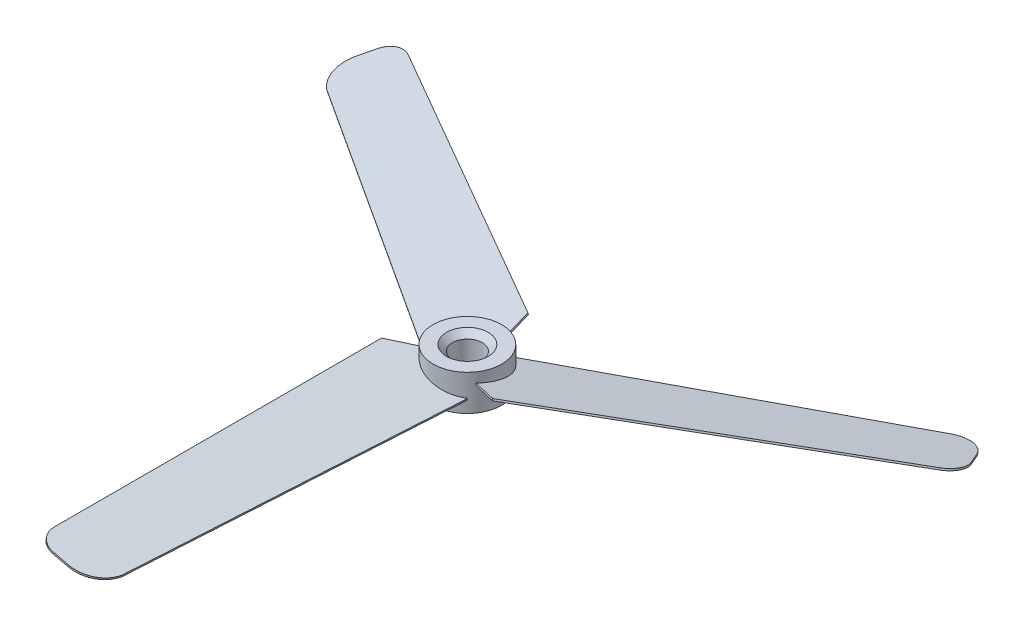
ISO-10303-21;
HEADER;
FILE_DESCRIPTION(('STEP AP214'),'2;1');
FILE_NAME('part.step','',(''),(''),'','','');
FILE_SCHEMA(('AUTOMOTIVE_DESIGN { 1 0 10303 214 1 1 1 1 }'));
ENDSEC;
DATA;
#1=APPLICATION_CONTEXT('core data for automotive mechanical design processes');
#2=APPLICATION_PROTOCOL_DEFINITION('international standard','automotive_design',2000,#1);
#3=PRODUCT_CONTEXT('',#1,'mechanical');
#4=PRODUCT('Part','Part','',(#3));
#5=PRODUCT_RELATED_PRODUCT_CATEGORY('part','',(#4));
#6=PRODUCT_DEFINITION_FORMATION('','',#4);
#7=PRODUCT_DEFINITION_CONTEXT('part definition',#1,'design');
#8=PRODUCT_DEFINITION('design','',#6,#7);
#9=PRODUCT_DEFINITION_SHAPE('','',#8);
#10=(LENGTH_UNIT() NAMED_UNIT(*) SI_UNIT(.MILLI.,.METRE.));
#11=(NAMED_UNIT(*) PLANE_ANGLE_UNIT() SI_UNIT($,.RADIAN.));
#12=(NAMED_UNIT(*) SI_UNIT($,.STERADIAN.) SOLID_ANGLE_UNIT());
#13=UNCERTAINTY_MEASURE_WITH_UNIT(LENGTH_MEASURE(1.E-05),#10,'distance_accuracy_value','');
#14=(GEOMETRIC_REPRESENTATION_CONTEXT(3) GLOBAL_UNCERTAINTY_ASSIGNED_CONTEXT((#13)) GLOBAL_UNIT_ASSIGNED_CONTEXT((#10,
#11,#12)) REPRESENTATION_CONTEXT('',''));
#15=CARTESIAN_POINT('',(0.,0.,0.));
#16=DIRECTION('',(0.,0.,1.));
#17=DIRECTION('',(1.,0.,0.));
#18=AXIS2_PLACEMENT_3D('',#15,#16,#17);
#19=CARTESIAN_POINT('',(0.,3.,0.));
#20=DIRECTION('',(0.,-1.,0.));
#21=DIRECTION('',(0.,0.,-1.));
#22=AXIS2_PLACEMENT_3D('',#19,#20,#21);
#23=CYLINDRICAL_SURFACE('',#22,5.75);
#24=CARTESIAN_POINT('',(0.,-19.4055087013538,0.));
#25=DIRECTION('',(0.443375650604073,0.224670968725066,0.867721722825674));
#26=DIRECTION('',(0.102227105047157,-0.974434685246857,0.200066646849336));
#27=AXIS2_PLACEMENT_3D('',#24,#25,#26);
#28=ELLIPSE('',#27,25.5929817396051,5.75);
#29=CARTESIAN_POINT('',(1.55101312725636,-1.0819336896782,-5.5368635777919));
#30=VERTEX_POINT('',#29);
#31=CARTESIAN_POINT('',(1.45445813438666,-0.790415335423243,-5.5630074182331));
#32=VERTEX_POINT('',#31);
#33=EDGE_CURVE('E60',#30,#32,#28,.T.);
#34=ORIENTED_EDGE('',*,*,#33,.F.);
#35=CARTESIAN_POINT('',(0.,-0.153945616169009,0.));
#36=DIRECTION('',(0.112475527171931,-0.974370064785235,0.194813327669882));
#37=DIRECTION('',(-0.48718503239261,-0.224951054343866,-0.843829228791108));
#38=AXIS2_PLACEMENT_3D('',#35,#36,#37);
#39=ELLIPSE('',#38,5.901248619812,5.75);
#40=CARTESIAN_POINT('',(4.7119520671484,1.04885957941083,3.2954525814971));
#41=VERTEX_POINT('',#40);
#42=EDGE_CURVE('E64',#30,#41,#39,.T.);
#43=ORIENTED_EDGE('',*,*,#42,.T.);
#44=CARTESIAN_POINT('',(0.,9.96257157509144,0.));
#45=DIRECTION('',(0.376322422140342,-0.139682244482034,-0.915898632584899));
#46=DIRECTION('',(-0.0530859955112098,-0.990196379803755,0.129201418351822));
#47=AXIS2_PLACEMENT_3D('',#44,#45,#46);
#48=ELLIPSE('',#47,41.1648597237395,5.75);
#49=CARTESIAN_POINT('',(4.7369454910711,1.35243251248231,3.25942439927991));
#50=VERTEX_POINT('',#49);
#51=EDGE_CURVE('E395',#50,#41,#48,.T.);
#52=ORIENTED_EDGE('',*,*,#51,.F.);
#53=CARTESIAN_POINT('',(0.,0.153945616169009,0.));
#54=DIRECTION('',(0.112475527171931,-0.974370064785235,0.194813327669882));
#55=DIRECTION('',(-0.48718503239261,-0.224951054343866,-0.843829228791108));
#56=AXIS2_PLACEMENT_3D('',#53,#54,#55);
#57=ELLIPSE('',#56,5.901248619812,5.75);
#58=EDGE_CURVE('E391',#32,#50,#57,.T.);
#59=ORIENTED_EDGE('',*,*,#58,.F.);
#60=EDGE_LOOP('',(#34,#43,#52,#59));
#61=FACE_BOUND('',#60,.T.);
#62=CARTESIAN_POINT('',(0.,-19.4055087013538,0.));
#63=DIRECTION('',(0.529781230080593,0.224670968725066,-0.81783543825542));
#64=DIRECTION('',(0.122149246097916,-0.974434685246857,-0.188564593350847));
#65=AXIS2_PLACEMENT_3D('',#62,#63,#64);
#66=ELLIPSE('',#65,25.5929817396051,5.75);
#67=CARTESIAN_POINT('',(-5.57057107928475,-1.08193368967819,1.42521501908883));
#68=VERTEX_POINT('',#67);
#69=CARTESIAN_POINT('',(-5.54493481282447,-0.790415335423243,1.52190601599681));
#70=VERTEX_POINT('',#69);
#71=EDGE_CURVE('E384',#68,#70,#66,.T.);
#72=ORIENTED_EDGE('',*,*,#71,.F.);
#73=CARTESIAN_POINT('',(0.,-0.153945616169009,0.));
#74=DIRECTION('',(0.112475527171934,-0.974370064785235,-0.194813327669881));
#75=DIRECTION('',(-0.487185032392622,-0.224951054343866,0.843829228791101));
#76=AXIS2_PLACEMENT_3D('',#73,#74,#75);
#77=ELLIPSE('',#76,5.901248619812,5.75);
#78=CARTESIAN_POINT('',(0.497969618969275,1.04885957941083,-5.72839648231367));
#79=VERTEX_POINT('',#78);
#80=EDGE_CURVE('E388',#68,#79,#77,.T.);
#81=ORIENTED_EDGE('',*,*,#80,.T.);
#82=CARTESIAN_POINT('',(0.,9.96257157509143,0.));
#83=DIRECTION('',(-0.981352694180123,-0.139682244482034,0.132044538705226));
#84=DIRECTION('',(0.138434708253263,-0.990196379803755,-0.018626888478017));
#85=AXIS2_PLACEMENT_3D('',#82,#83,#84);
#86=ELLIPSE('',#85,41.1648597237395,5.75);
#87=CARTESIAN_POINT('',(0.45427158595566,1.35243251248231,-5.73202733124968));
#88=VERTEX_POINT('',#87);
#89=EDGE_CURVE('E380',#88,#79,#86,.T.);
#90=ORIENTED_EDGE('',*,*,#89,.F.);
#91=CARTESIAN_POINT('',(0.,0.153945616169009,0.));
#92=DIRECTION('',(0.112475527171934,-0.974370064785235,-0.194813327669881));
#93=DIRECTION('',(-0.487185032392622,-0.224951054343866,0.843829228791101));
#94=AXIS2_PLACEMENT_3D('',#91,#92,#93);
#95=ELLIPSE('',#94,5.901248619812,5.75);
#96=EDGE_CURVE('E376',#70,#88,#95,.T.);
#97=ORIENTED_EDGE('',*,*,#96,.F.);
#98=EDGE_LOOP('',(#72,#81,#90,#97));
#99=FACE_BOUND('',#98,.T.);
#100=CARTESIAN_POINT('',(0.,-19.4055087013538,0.));
#101=DIRECTION('',(-0.97315688068467,0.224670968725066,-0.0498862845702472));
#102=DIRECTION('',(-0.224376351145074,-0.974434685246857,-0.0115020534984881));
#103=AXIS2_PLACEMENT_3D('',#100,#101,#102);
#104=ELLIPSE('',#103,25.5929817396051,5.75);
#105=CARTESIAN_POINT('',(4.01955795202844,-1.08193368967819,4.11164855870306));
#106=VERTEX_POINT('',#105);
#107=CARTESIAN_POINT('',(4.09047667843786,-0.790415335423243,4.04110140223628));
#108=VERTEX_POINT('',#107);
#109=EDGE_CURVE('E369',#106,#108,#104,.T.);
#110=ORIENTED_EDGE('',*,*,#109,.F.);
#111=CARTESIAN_POINT('',(0.,-0.153945616169009,0.));
#112=DIRECTION('',(-0.224951054343866,-0.974370064785235,0.));
#113=DIRECTION('',(0.974370064785235,-0.224951054343866,0.));
#114=AXIS2_PLACEMENT_3D('',#111,#112,#113);
#115=ELLIPSE('',#114,5.901248619812,5.75);
#116=CARTESIAN_POINT('',(-5.20992168611768,1.04885957941083,2.43294390081661));
#117=VERTEX_POINT('',#116);
#118=EDGE_CURVE('E373',#106,#117,#115,.T.);
#119=ORIENTED_EDGE('',*,*,#118,.T.);
#120=CARTESIAN_POINT('',(0.,9.96257157509143,0.));
#121=DIRECTION('',(0.605030272039788,-0.139682244482034,0.783854093879672));
#122=DIRECTION('',(-0.0853487127420546,-0.990196379803755,-0.110574529873804));
#123=AXIS2_PLACEMENT_3D('',#120,#121,#122);
#124=ELLIPSE('',#123,41.1648597237395,5.75);
#125=CARTESIAN_POINT('',(-5.19121707702676,1.35243251248231,2.47260293196982));
#126=VERTEX_POINT('',#125);
#127=EDGE_CURVE('E365',#126,#117,#124,.T.);
#128=ORIENTED_EDGE('',*,*,#127,.F.);
#129=CARTESIAN_POINT('',(0.,0.153945616169009,0.));
#130=DIRECTION('',(-0.224951054343866,-0.974370064785235,0.));
#131=DIRECTION('',(0.974370064785235,-0.224951054343866,0.));
#132=AXIS2_PLACEMENT_3D('',#129,#130,#131);
#133=ELLIPSE('',#132,5.901248619812,5.75);
#134=EDGE_CURVE('E358',#108,#126,#133,.T.);
#135=ORIENTED_EDGE('',*,*,#134,.F.);
#136=EDGE_LOOP('',(#110,#119,#128,#135));
#137=FACE_BOUND('',#136,.T.);
#138=CARTESIAN_POINT('',(0.,3.,0.));
#139=DIRECTION('',(0.,1.,0.));
#140=DIRECTION('',(0.,0.,1.));
#141=AXIS2_PLACEMENT_3D('',#138,#139,#140);
#142=CIRCLE('',#141,5.75);
#143=CARTESIAN_POINT('',(0.,3.,5.75));
#144=VERTEX_POINT('',#143);
#145=EDGE_CURVE('E354',#144,#144,#142,.T.);
#146=ORIENTED_EDGE('',*,*,#145,.F.);
#147=EDGE_LOOP('',(#146));
#148=FACE_BOUND('',#147,.T.);
#149=CARTESIAN_POINT('',(0.,-3.,0.));
#150=DIRECTION('',(0.,1.,0.));
#151=DIRECTION('',(0.,0.,1.));
#152=AXIS2_PLACEMENT_3D('',#149,#150,#151);
#153=CIRCLE('',#152,5.75);
#154=CARTESIAN_POINT('',(0.,-3.,5.75));
#155=VERTEX_POINT('',#154);
#156=EDGE_CURVE('E353',#155,#155,#153,.T.);
#157=ORIENTED_EDGE('',*,*,#156,.T.);
#158=EDGE_LOOP('',(#157));
#159=FACE_BOUND('',#158,.T.);
#160=ADVANCED_FACE('F43',(#61,#99,#137,#148,#159),#23,.T.);
#161=CARTESIAN_POINT('',(0.,3.,0.));
#162=DIRECTION('',(0.,1.,0.));
#163=DIRECTION('',(0.,0.,1.));
#164=AXIS2_PLACEMENT_3D('',#161,#162,#163);
#165=PLANE('',#164);
#166=CARTESIAN_POINT('',(0.,3.,0.));
#167=DIRECTION('',(0.,1.,0.));
#168=DIRECTION('',(0.,0.,1.));
#169=AXIS2_PLACEMENT_3D('',#166,#167,#168);
#170=CIRCLE('',#169,3.49999999999996);
#171=CARTESIAN_POINT('',(0.,3.,3.49999999999996));
#172=VERTEX_POINT('',#171);
#173=EDGE_CURVE('E11',#172,#172,#170,.F.);
#174=ORIENTED_EDGE('',*,*,#173,.T.);
#175=EDGE_LOOP('',(#174));
#176=FACE_BOUND('',#175,.T.);
#177=ORIENTED_EDGE('',*,*,#145,.T.);
#178=EDGE_LOOP('',(#177));
#179=FACE_BOUND('',#178,.T.);
#180=ADVANCED_FACE('F434',(#176,#179),#165,.T.);
#181=CARTESIAN_POINT('',(0.,-3.,0.));
#182=DIRECTION('',(0.,1.,0.));
#183=DIRECTION('',(0.,0.,1.));
#184=AXIS2_PLACEMENT_3D('',#181,#182,#183);
#185=PLANE('',#184);
#186=CARTESIAN_POINT('',(0.,-3.,0.));
#187=DIRECTION('',(0.,1.,0.));
#188=DIRECTION('',(0.,0.,1.));
#189=AXIS2_PLACEMENT_3D('',#186,#187,#188);
#190=CIRCLE('',#189,3.50000000000003);
#191=CARTESIAN_POINT('',(0.,-3.,3.50000000000003));
#192=VERTEX_POINT('',#191);
#193=EDGE_CURVE('E53',#192,#192,#190,.T.);
#194=ORIENTED_EDGE('',*,*,#193,.T.);
#195=EDGE_LOOP('',(#194));
#196=FACE_BOUND('',#195,.T.);
#197=ORIENTED_EDGE('',*,*,#156,.F.);
#198=EDGE_LOOP('',(#197));
#199=FACE_BOUND('',#198,.T.);
#200=ADVANCED_FACE('F413',(#196,#199),#185,.F.);
#201=CARTESIAN_POINT('',(4.11122933867557,-1.10309769689138,2.22805310777435));
#202=DIRECTION('',(-0.97315688068467,0.224670968725066,-0.0498862845702472));
#203=DIRECTION('',(-0.224951054343866,-0.974370064785235,0.));
#204=AXIS2_PLACEMENT_3D('',#201,#202,#203);
#205=PLANE('',#204);
#206=CARTESIAN_POINT('',(4.11122933867557,-1.10309769689138,2.22805310777435));
#207=CARTESIAN_POINT('',(1.33230436886286,-0.461532315837062,59.3273359162697));
#208=B_SPLINE_CURVE_WITH_KNOTS('',1,(#206,#207),.UNSPECIFIED.,.F.,.F.,(2,2),(0.,1.),.UNSPECIFIED.);
#209=CARTESIAN_POINT('',(1.33230436886285,-0.461532315837062,59.3273359162697));
#210=VERTEX_POINT('',#209);
#211=EDGE_CURVE('E286',#106,#210,#208,.T.);
#212=ORIENTED_EDGE('',*,*,#211,.F.);
#213=ORIENTED_EDGE('',*,*,#109,.T.);
#214=CARTESIAN_POINT('',(4.17871465497873,-0.810786677455814,2.22805310777435));
#215=CARTESIAN_POINT('',(1.39978968516602,-0.169221296401491,59.3273359162697));
#216=B_SPLINE_CURVE_WITH_KNOTS('',1,(#214,#215),.UNSPECIFIED.,.F.,.F.,(2,2),(0.,1.),.UNSPECIFIED.);
#217=CARTESIAN_POINT('',(1.39978968516601,-0.169221296401491,59.3273359162697));
#218=VERTEX_POINT('',#217);
#219=EDGE_CURVE('E285',#108,#218,#216,.T.);
#220=ORIENTED_EDGE('',*,*,#219,.T.);
#221=DIRECTION('',(0.224951054343866,0.974370064785235,0.));
#222=VECTOR('',#221,1.);
#223=CARTESIAN_POINT('',(1.33230436886285,-0.461532315837062,59.3273359162697));
#224=LINE('',#223,#222);
#225=EDGE_CURVE('E349',#210,#218,#224,.T.);
#226=ORIENTED_EDGE('',*,*,#225,.F.);
#227=EDGE_LOOP('',(#212,#213,#220,#226));
#228=FACE_BOUND('',#227,.T.);
#229=ADVANCED_FACE('F445',(#228),#205,.F.);
#230=CARTESIAN_POINT('',(-3.47238894338371,0.647718538074396,58.5));
#231=DIRECTION('',(0.224951054343866,0.974370064785235,0.));
#232=DIRECTION('',(-0.974370064785235,0.224951054343866,0.));
#233=AXIS2_PLACEMENT_3D('',#230,#231,#232);
#234=CYLINDRICAL_SURFACE('',#233,5.);
#235=CARTESIAN_POINT('',(-3.40490362708055,0.940029557509967,58.5));
#236=DIRECTION('',(-0.224951054343866,-0.974370064785235,0.));
#237=DIRECTION('',(0.974370064785235,-0.224951054343866,0.));
#238=AXIS2_PLACEMENT_3D('',#235,#236,#237);
#239=CIRCLE('',#238,5.);
#240=CARTESIAN_POINT('',(-3.40490362708055,0.940029557509967,63.5));
#241=VERTEX_POINT('',#240);
#242=EDGE_CURVE('E316',#218,#241,#239,.T.);
#243=ORIENTED_EDGE('',*,*,#242,.T.);
#244=DIRECTION('',(0.224951054343866,0.974370064785235,0.));
#245=VECTOR('',#244,1.);
#246=CARTESIAN_POINT('',(-3.47238894338371,0.647718538074396,63.5));
#247=LINE('',#246,#245);
#248=CARTESIAN_POINT('',(-3.47238894338371,0.647718538074396,63.5));
#249=VERTEX_POINT('',#248);
#250=EDGE_CURVE('E345',#249,#241,#247,.T.);
#251=ORIENTED_EDGE('',*,*,#250,.F.);
#252=CARTESIAN_POINT('',(-3.47238894338371,0.647718538074396,58.5));
#253=DIRECTION('',(-0.224951054343866,-0.974370064785235,0.));
#254=DIRECTION('',(0.974370064785235,-0.224951054343866,0.));
#255=AXIS2_PLACEMENT_3D('',#252,#253,#254);
#256=CIRCLE('',#255,5.);
#257=EDGE_CURVE('E291',#210,#249,#256,.T.);
#258=ORIENTED_EDGE('',*,*,#257,.F.);
#259=ORIENTED_EDGE('',*,*,#225,.T.);
#260=EDGE_LOOP('',(#243,#251,#258,#259));
#261=FACE_BOUND('',#260,.T.);
#262=ADVANCED_FACE('F450',(#261),#234,.T.);
#263=CARTESIAN_POINT('',(-6.05705871859665,1.24443657373473,63.5));
#264=DIRECTION('',(0.,0.,-1.));
#265=DIRECTION('',(-1.,0.,0.));
#266=AXIS2_PLACEMENT_3D('',#263,#264,#265);
#267=PLANE('',#266);
#268=DIRECTION('',(-0.974370064785235,0.224951054343866,0.));
#269=VECTOR('',#268,1.);
#270=CARTESIAN_POINT('',(-5.9895734022935,1.5367475931703,63.5));
#271=LINE('',#270,#269);
#272=CARTESIAN_POINT('',(-5.9895734022935,1.5367475931703,63.5));
#273=VERTEX_POINT('',#272);
#274=EDGE_CURVE('E322',#241,#273,#271,.T.);
#275=ORIENTED_EDGE('',*,*,#274,.T.);
#276=DIRECTION('',(0.224951054343866,0.974370064785235,0.));
#277=VECTOR('',#276,1.);
#278=CARTESIAN_POINT('',(-6.05705871859665,1.24443657373473,63.5));
#279=LINE('',#278,#277);
#280=CARTESIAN_POINT('',(-6.05705871859665,1.24443657373473,63.5));
#281=VERTEX_POINT('',#280);
#282=EDGE_CURVE('E341',#281,#273,#279,.T.);
#283=ORIENTED_EDGE('',*,*,#282,.F.);
#284=DIRECTION('',(-0.974370064785235,0.224951054343866,0.));
#285=VECTOR('',#284,1.);
#286=CARTESIAN_POINT('',(-6.05705871859665,1.24443657373473,63.5));
#287=LINE('',#286,#285);
#288=EDGE_CURVE('E298',#249,#281,#287,.T.);
#289=ORIENTED_EDGE('',*,*,#288,.F.);
#290=ORIENTED_EDGE('',*,*,#250,.T.);
#291=EDGE_LOOP('',(#275,#283,#289,#290));
#292=FACE_BOUND('',#291,.T.);
#293=ADVANCED_FACE('F461',(#292),#267,.F.);
#294=CARTESIAN_POINT('',(-6.05705871859665,1.24443657373473,60.5));
#295=DIRECTION('',(0.224951054343866,0.974370064785235,0.));
#296=DIRECTION('',(-0.974370064785235,0.224951054343866,0.));
#297=AXIS2_PLACEMENT_3D('',#294,#295,#296);
#298=CYLINDRICAL_SURFACE('',#297,3.);
#299=CARTESIAN_POINT('',(-5.9895734022935,1.5367475931703,60.5));
#300=DIRECTION('',(-0.224951054343866,-0.974370064785235,0.));
#301=DIRECTION('',(-0.974370064785235,0.224951054343866,0.));
#302=AXIS2_PLACEMENT_3D('',#299,#300,#301);
#303=CIRCLE('',#302,3.);
#304=CARTESIAN_POINT('',(-8.9126835966492,2.21160075620189,60.5));
#305=VERTEX_POINT('',#304);
#306=EDGE_CURVE('E325',#273,#305,#303,.T.);
#307=ORIENTED_EDGE('',*,*,#306,.T.);
#308=DIRECTION('',(0.224951054343866,0.974370064785235,0.));
#309=VECTOR('',#308,1.);
#310=CARTESIAN_POINT('',(-8.98016891295236,1.91928973676632,60.5));
#311=LINE('',#310,#309);
#312=CARTESIAN_POINT('',(-8.98016891295236,1.91928973676632,60.5));
#313=VERTEX_POINT('',#312);
#314=EDGE_CURVE('E337',#313,#305,#311,.T.);
#315=ORIENTED_EDGE('',*,*,#314,.F.);
#316=CARTESIAN_POINT('',(-6.05705871859665,1.24443657373473,60.5));
#317=DIRECTION('',(-0.224951054343866,-0.974370064785235,0.));
#318=DIRECTION('',(-0.974370064785235,0.224951054343866,0.));
#319=AXIS2_PLACEMENT_3D('',#316,#317,#318);
#320=CIRCLE('',#319,3.);
#321=EDGE_CURVE('E301',#281,#313,#320,.T.);
#322=ORIENTED_EDGE('',*,*,#321,.F.);
#323=ORIENTED_EDGE('',*,*,#282,.T.);
#324=EDGE_LOOP('',(#307,#315,#322,#323));
#325=FACE_BOUND('',#324,.T.);
#326=ADVANCED_FACE('F465',(#325),#298,.T.);
#327=CARTESIAN_POINT('',(-8.98016891295236,1.91928973676632,5.4981793344433));
#328=DIRECTION('',(0.974370064785235,-0.224951054343866,0.));
#329=DIRECTION('',(0.224951054343866,0.974370064785235,0.));
#330=AXIS2_PLACEMENT_3D('',#327,#328,#329);
#331=PLANE('',#330);
#332=DIRECTION('',(0.,0.,-1.));
#333=VECTOR('',#332,1.);
#334=CARTESIAN_POINT('',(-8.9126835966492,2.21160075620189,5.4981793344433));
#335=LINE('',#334,#333);
#336=CARTESIAN_POINT('',(-8.9126835966492,2.21160075620189,5.4981793344433));
#337=VERTEX_POINT('',#336);
#338=EDGE_CURVE('E328',#305,#337,#335,.T.);
#339=ORIENTED_EDGE('',*,*,#338,.T.);
#340=DIRECTION('',(0.224951054343866,0.974370064785235,0.));
#341=VECTOR('',#340,1.);
#342=CARTESIAN_POINT('',(-8.98016891295236,1.91928973676632,5.4981793344433));
#343=LINE('',#342,#341);
#344=CARTESIAN_POINT('',(-8.98016891295236,1.91928973676632,5.4981793344433));
#345=VERTEX_POINT('',#344);
#346=EDGE_CURVE('E311',#345,#337,#343,.T.);
#347=ORIENTED_EDGE('',*,*,#346,.F.);
#348=DIRECTION('',(0.,0.,-1.));
#349=VECTOR('',#348,1.);
#350=CARTESIAN_POINT('',(-8.98016891295236,1.91928973676632,5.4981793344433));
#351=LINE('',#350,#349);
#352=EDGE_CURVE('E304',#313,#345,#351,.T.);
#353=ORIENTED_EDGE('',*,*,#352,.F.);
#354=ORIENTED_EDGE('',*,*,#314,.T.);
#355=EDGE_LOOP('',(#339,#347,#353,#354));
#356=FACE_BOUND('',#355,.T.);
#357=ADVANCED_FACE('F469',(#356),#331,.F.);
#358=CARTESIAN_POINT('',(-4.53405056062525,0.89282243523439,1.88345629489007));
#359=DIRECTION('',(0.605030272039788,-0.139682244482034,0.783854093879672));
#360=DIRECTION('',(0.791614784569322,0.,-0.611020484804942));
#361=AXIS2_PLACEMENT_3D('',#358,#359,#360);
#362=PLANE('',#361);
#363=DIRECTION('',(0.763763964235707,-0.176328804869987,-0.620945053533788));
#364=VECTOR('',#363,1.);
#365=CARTESIAN_POINT('',(-4.46656524432209,1.18513345466996,1.88345629489007));
#366=LINE('',#365,#364);
#367=EDGE_CURVE('E292',#337,#126,#366,.T.);
#368=ORIENTED_EDGE('',*,*,#367,.T.);
#369=ORIENTED_EDGE('',*,*,#127,.T.);
#370=DIRECTION('',(0.763763964235707,-0.176328804869987,-0.620945053533788));
#371=VECTOR('',#370,1.);
#372=CARTESIAN_POINT('',(-4.53405056062525,0.89282243523439,1.88345629489007));
#373=LINE('',#372,#371);
#374=EDGE_CURVE('E307',#345,#117,#373,.T.);
#375=ORIENTED_EDGE('',*,*,#374,.F.);
#376=ORIENTED_EDGE('',*,*,#346,.T.);
#377=EDGE_LOOP('',(#368,#369,#375,#376));
#378=FACE_BOUND('',#377,.T.);
#379=ADVANCED_FACE('F473',(#378),#362,.F.);
#380=CARTESIAN_POINT('',(-0.225975135903513,-0.101775145303611,5.49732245663152));
#381=DIRECTION('',(-0.224951054343866,-0.974370064785235,0.));
#382=DIRECTION('',(0.974370064785235,-0.224951054343866,0.));
#383=AXIS2_PLACEMENT_3D('',#380,#381,#382);
#384=PLANE('',#383);
#385=ORIENTED_EDGE('',*,*,#118,.F.);
#386=ORIENTED_EDGE('',*,*,#211,.T.);
#387=ORIENTED_EDGE('',*,*,#257,.T.);
#388=ORIENTED_EDGE('',*,*,#288,.T.);
#389=ORIENTED_EDGE('',*,*,#321,.T.);
#390=ORIENTED_EDGE('',*,*,#352,.T.);
#391=ORIENTED_EDGE('',*,*,#374,.T.);
#392=EDGE_LOOP('',(#385,#386,#387,#388,#389,#390,#391));
#393=FACE_BOUND('',#392,.T.);
#394=ADVANCED_FACE('F477',(#393),#384,.T.);
#395=CARTESIAN_POINT('',(-0.158489819600353,0.190535874131959,5.49732245663152));
#396=DIRECTION('',(-0.224951054343866,-0.974370064785235,0.));
#397=DIRECTION('',(0.974370064785235,-0.224951054343866,0.));
#398=AXIS2_PLACEMENT_3D('',#395,#396,#397);
#399=PLANE('',#398);
#400=ORIENTED_EDGE('',*,*,#219,.F.);
#401=ORIENTED_EDGE('',*,*,#134,.T.);
#402=ORIENTED_EDGE('',*,*,#367,.F.);
#403=ORIENTED_EDGE('',*,*,#338,.F.);
#404=ORIENTED_EDGE('',*,*,#306,.F.);
#405=ORIENTED_EDGE('',*,*,#274,.F.);
#406=ORIENTED_EDGE('',*,*,#242,.F.);
#407=EDGE_LOOP('',(#400,#401,#402,#403,#404,#405,#406));
#408=FACE_BOUND('',#407,.T.);
#409=ADVANCED_FACE('F426',(#408),#399,.F.);
#410=CARTESIAN_POINT('',(0.,3.,0.));
#411=DIRECTION('',(0.,-1.,0.));
#412=DIRECTION('',(0.,0.,-1.));
#413=AXIS2_PLACEMENT_3D('',#410,#411,#412);
#414=CYLINDRICAL_SURFACE('',#413,2.5);
#415=CARTESIAN_POINT('',(0.,-1.99999999999997,0.));
#416=DIRECTION('',(0.,1.,0.));
#417=DIRECTION('',(0.,0.,1.));
#418=AXIS2_PLACEMENT_3D('',#415,#416,#417);
#419=CIRCLE('',#418,2.5);
#420=CARTESIAN_POINT('',(0.,-1.99999999999997,2.5));
#421=VERTEX_POINT('',#420);
#422=EDGE_CURVE('E406',#421,#421,#419,.F.);
#423=ORIENTED_EDGE('',*,*,#422,.T.);
#424=EDGE_LOOP('',(#423));
#425=FACE_BOUND('',#424,.T.);
#426=CARTESIAN_POINT('',(0.,2.00000000000003,0.));
#427=DIRECTION('',(0.,1.,0.));
#428=DIRECTION('',(0.,0.,1.));
#429=AXIS2_PLACEMENT_3D('',#426,#427,#428);
#430=CIRCLE('',#429,2.5);
#431=CARTESIAN_POINT('',(0.,2.00000000000003,2.5));
#432=VERTEX_POINT('',#431);
#433=EDGE_CURVE('E402',#432,#432,#430,.T.);
#434=ORIENTED_EDGE('',*,*,#433,.T.);
#435=EDGE_LOOP('',(#434));
#436=FACE_BOUND('',#435,.T.);
#437=ADVANCED_FACE('F422',(#425,#436),#414,.F.);
#438=CARTESIAN_POINT('',(-3.98516526165125,-1.10309769689138,2.44640249418975));
#439=DIRECTION('',(0.529781230080593,0.224670968725066,-0.81783543825542));
#440=DIRECTION('',(-0.839292207715528,0.,-0.54368059563313));
#441=AXIS2_PLACEMENT_3D('',#438,#439,#440);
#442=PLANE('',#441);
#443=CARTESIAN_POINT('',(-3.98516526165125,-1.10309769689138,2.44640249418975));
#444=CARTESIAN_POINT('',(-52.0451322267738,-0.461532315837062,-28.5098585291269));
#445=B_SPLINE_CURVE_WITH_KNOTS('',1,(#443,#444),.UNSPECIFIED.,.F.,.F.,(2,2),(0.,1.),.UNSPECIFIED.);
#446=CARTESIAN_POINT('',(-52.0451322267738,-0.461532315837062,-28.5098585291269));
#447=VERTEX_POINT('',#446);
#448=EDGE_CURVE('E221',#68,#447,#445,.T.);
#449=ORIENTED_EDGE('',*,*,#448,.F.);
#450=ORIENTED_EDGE('',*,*,#71,.T.);
#451=CARTESIAN_POINT('',(-4.01890791980283,-0.810786677455814,2.50484649249071));
#452=CARTESIAN_POINT('',(-52.0788748849254,-0.169221296401491,-28.4514145308259));
#453=B_SPLINE_CURVE_WITH_KNOTS('',1,(#451,#452),.UNSPECIFIED.,.F.,.F.,(2,2),(0.,1.),.UNSPECIFIED.);
#454=CARTESIAN_POINT('',(-52.0788748849254,-0.169221296401491,-28.4514145308259));
#455=VERTEX_POINT('',#454);
#456=EDGE_CURVE('E211',#70,#455,#453,.T.);
#457=ORIENTED_EDGE('',*,*,#456,.T.);
#458=DIRECTION('',(-0.112475527171934,0.974370064785235,0.194813327669881));
#459=VECTOR('',#458,1.);
#460=CARTESIAN_POINT('',(-52.0451322267738,-0.461532315837062,-28.5098585291269));
#461=LINE('',#460,#459);
#462=EDGE_CURVE('E281',#447,#455,#461,.T.);
#463=ORIENTED_EDGE('',*,*,#462,.F.);
#464=EDGE_LOOP('',(#449,#450,#457,#463));
#465=FACE_BOUND('',#464,.T.);
#466=ADVANCED_FACE('F425',(#465),#442,.F.);
#467=CARTESIAN_POINT('',(-48.9262916496977,0.647718538074396,-32.2571770367907));
#468=DIRECTION('',(-0.112475527171934,0.974370064785235,0.194813327669881));
#469=DIRECTION('',(0.,-0.196057410916244,0.980592418706579));
#470=AXIS2_PLACEMENT_3D('',#467,#468,#469);
#471=CYLINDRICAL_SURFACE('',#470,5.);
#472=CARTESIAN_POINT('',(-48.9600343078492,0.940029557509967,-32.1987330384898));
#473=DIRECTION('',(0.112475527171934,-0.974370064785235,-0.194813327669881));
#474=DIRECTION('',(-0.487185032392622,-0.224951054343866,0.843829228791101));
#475=AXIS2_PLACEMENT_3D('',#472,#473,#474);
#476=CIRCLE('',#475,5.);
#477=CARTESIAN_POINT('',(-53.2901613267714,0.940029557509967,-34.6987330384898));
#478=VERTEX_POINT('',#477);
#479=EDGE_CURVE('E215',#455,#478,#476,.T.);
#480=ORIENTED_EDGE('',*,*,#479,.T.);
#481=DIRECTION('',(-0.112475527171934,0.974370064785235,0.194813327669881));
#482=VECTOR('',#481,1.);
#483=CARTESIAN_POINT('',(-53.2564186686198,0.647718538074396,-34.7571770367908));
#484=LINE('',#483,#482);
#485=CARTESIAN_POINT('',(-53.2564186686198,0.647718538074396,-34.7571770367908));
#486=VERTEX_POINT('',#485);
#487=EDGE_CURVE('E277',#486,#478,#484,.T.);
#488=ORIENTED_EDGE('',*,*,#487,.F.);
#489=CARTESIAN_POINT('',(-48.9262916496977,0.647718538074396,-32.2571770367907));
#490=DIRECTION('',(0.112475527171934,-0.974370064785235,-0.194813327669881));
#491=DIRECTION('',(-0.487185032392622,-0.224951054343866,0.843829228791101));
#492=AXIS2_PLACEMENT_3D('',#489,#490,#491);
#493=CIRCLE('',#492,5.);
#494=EDGE_CURVE('E226',#447,#486,#493,.T.);
#495=ORIENTED_EDGE('',*,*,#494,.F.);
#496=ORIENTED_EDGE('',*,*,#462,.T.);
#497=EDGE_LOOP('',(#480,#488,#495,#496));
#498=FACE_BOUND('',#497,.T.);
#499=ADVANCED_FACE('F487',(#498),#471,.T.);
#500=CARTESIAN_POINT('',(-51.9640837810134,1.24443657373473,-36.995566722519));
#501=DIRECTION('',(0.866025403784436,0.,0.500000000000004));
#502=DIRECTION('',(0.500000000000004,0.,-0.866025403784436));
#503=AXIS2_PLACEMENT_3D('',#500,#501,#502);
#504=PLANE('',#503);
#505=DIRECTION('',(0.487185032392622,0.224951054343866,-0.843829228791101));
#506=VECTOR('',#505,1.);
#507=CARTESIAN_POINT('',(-51.9978264391649,1.5367475931703,-36.937122724218));
#508=LINE('',#507,#506);
#509=CARTESIAN_POINT('',(-51.9978264391649,1.5367475931703,-36.937122724218));
#510=VERTEX_POINT('',#509);
#511=EDGE_CURVE('E254',#478,#510,#508,.T.);
#512=ORIENTED_EDGE('',*,*,#511,.T.);
#513=DIRECTION('',(-0.112475527171934,0.974370064785235,0.194813327669881));
#514=VECTOR('',#513,1.);
#515=CARTESIAN_POINT('',(-51.9640837810134,1.24443657373473,-36.995566722519));
#516=LINE('',#515,#514);
#517=CARTESIAN_POINT('',(-51.9640837810134,1.24443657373473,-36.995566722519));
#518=VERTEX_POINT('',#517);
#519=EDGE_CURVE('E273',#518,#510,#516,.T.);
#520=ORIENTED_EDGE('',*,*,#519,.F.);
#521=DIRECTION('',(0.487185032392622,0.224951054343866,-0.843829228791101));
#522=VECTOR('',#521,1.);
#523=CARTESIAN_POINT('',(-51.9640837810134,1.24443657373473,-36.995566722519));
#524=LINE('',#523,#522);
#525=EDGE_CURVE('E233',#486,#518,#524,.T.);
#526=ORIENTED_EDGE('',*,*,#525,.F.);
#527=ORIENTED_EDGE('',*,*,#487,.T.);
#528=EDGE_LOOP('',(#512,#520,#526,#527));
#529=FACE_BOUND('',#528,.T.);
#530=ADVANCED_FACE('F491',(#529),#504,.F.);
#531=CARTESIAN_POINT('',(-49.3660075696601,1.24443657373473,-35.495566722519));
#532=DIRECTION('',(-0.112475527171934,0.974370064785235,0.194813327669881));
#533=DIRECTION('',(0.,-0.196057410916244,0.980592418706579));
#534=AXIS2_PLACEMENT_3D('',#531,#532,#533);
#535=CYLINDRICAL_SURFACE('',#534,3.);
#536=CARTESIAN_POINT('',(-49.3997502278116,1.5367475931703,-35.437122724218));
#537=DIRECTION('',(0.112475527171934,-0.974370064785235,-0.194813327669881));
#538=DIRECTION('',(0.487185032392622,0.224951054343866,-0.843829228791101));
#539=AXIS2_PLACEMENT_3D('',#536,#537,#538);
#540=CIRCLE('',#539,3.);
#541=CARTESIAN_POINT('',(-47.9381951306338,2.21160075620189,-37.9686104105913));
#542=VERTEX_POINT('',#541);
#543=EDGE_CURVE('E257',#510,#542,#540,.T.);
#544=ORIENTED_EDGE('',*,*,#543,.T.);
#545=DIRECTION('',(-0.112475527171934,0.974370064785235,0.194813327669881));
#546=VECTOR('',#545,1.);
#547=CARTESIAN_POINT('',(-47.9044524724822,1.91928973676632,-38.0270544088923));
#548=LINE('',#547,#546);
#549=CARTESIAN_POINT('',(-47.9044524724822,1.91928973676632,-38.0270544088923));
#550=VERTEX_POINT('',#549);
#551=EDGE_CURVE('E269',#550,#542,#548,.T.);
#552=ORIENTED_EDGE('',*,*,#551,.F.);
#553=CARTESIAN_POINT('',(-49.3660075696601,1.24443657373473,-35.495566722519));
#554=DIRECTION('',(0.112475527171934,-0.974370064785235,-0.194813327669881));
#555=DIRECTION('',(0.487185032392622,0.224951054343866,-0.843829228791101));
#556=AXIS2_PLACEMENT_3D('',#553,#554,#555);
#557=CIRCLE('',#556,3.);
#558=EDGE_CURVE('E236',#518,#550,#557,.T.);
#559=ORIENTED_EDGE('',*,*,#558,.F.);
#560=ORIENTED_EDGE('',*,*,#519,.T.);
#561=EDGE_LOOP('',(#544,#552,#559,#560));
#562=FACE_BOUND('',#561,.T.);
#563=ADVANCED_FACE('F495',(#562),#535,.T.);
#564=CARTESIAN_POINT('',(-0.271478521714285,1.91928973676632,-10.5261440761137));
#565=DIRECTION('',(-0.487185032392621,-0.224951054343866,0.843829228791101));
#566=DIRECTION('',(0.866025403784436,0.,0.500000000000004));
#567=AXIS2_PLACEMENT_3D('',#564,#565,#566);
#568=PLANE('',#567);
#569=DIRECTION('',(0.866025403784436,0.,0.500000000000004));
#570=VECTOR('',#569,1.);
#571=CARTESIAN_POINT('',(-0.305221179865865,2.21160075620189,-10.4677000778127));
#572=LINE('',#571,#570);
#573=CARTESIAN_POINT('',(-0.305221179865865,2.21160075620189,-10.4677000778127));
#574=VERTEX_POINT('',#573);
#575=EDGE_CURVE('E260',#542,#574,#572,.T.);
#576=ORIENTED_EDGE('',*,*,#575,.T.);
#577=DIRECTION('',(-0.112475527171934,0.974370064785235,0.194813327669881));
#578=VECTOR('',#577,1.);
#579=CARTESIAN_POINT('',(-0.271478521714285,1.91928973676632,-10.5261440761137));
#580=LINE('',#579,#578);
#581=CARTESIAN_POINT('',(-0.271478521714285,1.91928973676632,-10.5261440761137));
#582=VERTEX_POINT('',#581);
#583=EDGE_CURVE('E245',#582,#574,#580,.T.);
#584=ORIENTED_EDGE('',*,*,#583,.F.);
#585=DIRECTION('',(0.866025403784436,0.,0.500000000000004));
#586=VECTOR('',#585,1.);
#587=CARTESIAN_POINT('',(-0.271478521714285,1.91928973676632,-10.5261440761137));
#588=LINE('',#587,#586);
#589=EDGE_CURVE('E239',#550,#582,#588,.T.);
#590=ORIENTED_EDGE('',*,*,#589,.F.);
#591=ORIENTED_EDGE('',*,*,#551,.T.);
#592=EDGE_LOOP('',(#576,#584,#590,#591));
#593=FACE_BOUND('',#592,.T.);
#594=ADVANCED_FACE('F499',(#593),#568,.F.);
#595=CARTESIAN_POINT('',(0.635904282020127,0.89282243523439,-4.86833111498958));
#596=DIRECTION('',(-0.981352694180123,-0.139682244482034,0.132044538705226));
#597=DIRECTION('',(0.140916136577712,-0.990021536357675,0.));
#598=AXIS2_PLACEMENT_3D('',#595,#596,#597);
#599=PLANE('',#598);
#600=DIRECTION('',(0.15587220859669,-0.176328804869987,0.971911522290127));
#601=VECTOR('',#600,1.);
#602=CARTESIAN_POINT('',(0.602161623868547,1.18513345466996,-4.80988711668861));
#603=LINE('',#602,#601);
#604=EDGE_CURVE('E227',#574,#88,#603,.T.);
#605=ORIENTED_EDGE('',*,*,#604,.T.);
#606=ORIENTED_EDGE('',*,*,#89,.T.);
#607=DIRECTION('',(0.15587220859669,-0.176328804869987,0.971911522290127));
#608=VECTOR('',#607,1.);
#609=CARTESIAN_POINT('',(0.635904282020127,0.89282243523439,-4.86833111498958));
#610=LINE('',#609,#608);
#611=EDGE_CURVE('E242',#582,#79,#610,.T.);
#612=ORIENTED_EDGE('',*,*,#611,.F.);
#613=ORIENTED_EDGE('',*,*,#583,.T.);
#614=EDGE_LOOP('',(#605,#606,#612,#613));
#615=FACE_BOUND('',#614,.T.);
#616=ADVANCED_FACE('F503',(#615),#599,.F.);
#617=CARTESIAN_POINT('',(-4.64783333228581,-0.101775145303611,-2.94436143663186));
#618=DIRECTION('',(0.112475527171934,-0.974370064785235,-0.194813327669881));
#619=DIRECTION('',(-0.487185032392622,-0.224951054343866,0.843829228791101));
#620=AXIS2_PLACEMENT_3D('',#617,#618,#619);
#621=PLANE('',#620);
#622=ORIENTED_EDGE('',*,*,#80,.F.);
#623=ORIENTED_EDGE('',*,*,#448,.T.);
#624=ORIENTED_EDGE('',*,*,#494,.T.);
#625=ORIENTED_EDGE('',*,*,#525,.T.);
#626=ORIENTED_EDGE('',*,*,#558,.T.);
#627=ORIENTED_EDGE('',*,*,#589,.T.);
#628=ORIENTED_EDGE('',*,*,#611,.T.);
#629=EDGE_LOOP('',(#622,#623,#624,#625,#626,#627,#628));
#630=FACE_BOUND('',#629,.T.);
#631=ADVANCED_FACE('F507',(#630),#621,.T.);
#632=CARTESIAN_POINT('',(-4.68157599043739,0.190535874131959,-2.8859174383309));
#633=DIRECTION('',(0.112475527171934,-0.974370064785235,-0.194813327669881));
#634=DIRECTION('',(-0.487185032392622,-0.224951054343866,0.843829228791101));
#635=AXIS2_PLACEMENT_3D('',#632,#633,#634);
#636=PLANE('',#635);
#637=ORIENTED_EDGE('',*,*,#456,.F.);
#638=ORIENTED_EDGE('',*,*,#96,.T.);
#639=ORIENTED_EDGE('',*,*,#604,.F.);
#640=ORIENTED_EDGE('',*,*,#575,.F.);
#641=ORIENTED_EDGE('',*,*,#543,.F.);
#642=ORIENTED_EDGE('',*,*,#511,.F.);
#643=ORIENTED_EDGE('',*,*,#479,.F.);
#644=EDGE_LOOP('',(#637,#638,#639,#640,#641,#642,#643));
#645=FACE_BOUND('',#644,.T.);
#646=ADVANCED_FACE('F509',(#645),#636,.F.);
#647=CARTESIAN_POINT('',(-0.126064077024285,-1.10309769689138,-4.67445560196412));
#648=DIRECTION('',(0.443375650604073,0.224670968725066,0.867721722825674));
#649=DIRECTION('',(0.890487311220712,0.,-0.455008075263404));
#650=AXIS2_PLACEMENT_3D('',#647,#648,#649);
#651=PLANE('',#650);
#652=CARTESIAN_POINT('',(-0.126064077024285,-1.10309769689138,-4.67445560196412));
#653=CARTESIAN_POINT('',(50.7128278579114,-0.461532315837062,-30.8174773871426));
#654=B_SPLINE_CURVE_WITH_KNOTS('',1,(#652,#653),.UNSPECIFIED.,.F.,.F.,(2,2),(0.,1.),.UNSPECIFIED.);
#655=CARTESIAN_POINT('',(50.7128278579114,-0.461532315837062,-30.8174773871426));
#656=VERTEX_POINT('',#655);
#657=EDGE_CURVE('E185',#30,#656,#654,.T.);
#658=ORIENTED_EDGE('',*,*,#657,.F.);
#659=ORIENTED_EDGE('',*,*,#33,.T.);
#660=CARTESIAN_POINT('',(-0.159806735175864,-0.810786677455814,-4.73289960026508));
#661=CARTESIAN_POINT('',(50.6790851997598,-0.169221296401491,-30.8759213854436));
#662=B_SPLINE_CURVE_WITH_KNOTS('',1,(#660,#661),.UNSPECIFIED.,.F.,.F.,(2,2),(0.,1.),.UNSPECIFIED.);
#663=CARTESIAN_POINT('',(50.6790851997598,-0.169221296401491,-30.8759213854436));
#664=VERTEX_POINT('',#663);
#665=EDGE_CURVE('E208',#32,#664,#662,.T.);
#666=ORIENTED_EDGE('',*,*,#665,.T.);
#667=DIRECTION('',(-0.112475527171931,0.974370064785235,-0.194813327669882));
#668=VECTOR('',#667,1.);
#669=CARTESIAN_POINT('',(50.7128278579114,-0.461532315837062,-30.8174773871426));
#670=LINE('',#669,#668);
#671=EDGE_CURVE('E199',#656,#664,#670,.T.);
#672=ORIENTED_EDGE('',*,*,#671,.F.);
#673=EDGE_LOOP('',(#658,#659,#666,#672));
#674=FACE_BOUND('',#673,.T.);
#675=ADVANCED_FACE('F206',(#674),#651,.F.);
#676=CARTESIAN_POINT('',(52.3986805930818,0.647718538074396,-26.242822963209));
#677=DIRECTION('',(-0.112475527171931,0.974370064785235,-0.194813327669882));
#678=DIRECTION('',(0.,0.196057410916245,0.980592418706579));
#679=AXIS2_PLACEMENT_3D('',#676,#677,#678);
#680=CYLINDRICAL_SURFACE('',#679,5.);
#681=CARTESIAN_POINT('',(52.3649379349302,0.940029557509967,-26.30126696151));
#682=DIRECTION('',(0.112475527171931,-0.974370064785235,0.194813327669882));
#683=DIRECTION('',(-0.48718503239261,-0.224951054343866,-0.843829228791107));
#684=AXIS2_PLACEMENT_3D('',#681,#682,#683);
#685=CIRCLE('',#684,5.);
#686=CARTESIAN_POINT('',(56.6950649538524,0.940029557509967,-28.8012669615099));
#687=VERTEX_POINT('',#686);
#688=EDGE_CURVE('E727',#664,#687,#685,.T.);
#689=ORIENTED_EDGE('',*,*,#688,.T.);
#690=DIRECTION('',(-0.112475527171931,0.974370064785235,-0.194813327669882));
#691=VECTOR('',#690,1.);
#692=CARTESIAN_POINT('',(56.728807612004,0.647718538074396,-28.742822963209));
#693=LINE('',#692,#691);
#694=CARTESIAN_POINT('',(56.728807612004,0.647718538074396,-28.742822963209));
#695=VERTEX_POINT('',#694);
#696=EDGE_CURVE('E201',#695,#687,#693,.T.);
#697=ORIENTED_EDGE('',*,*,#696,.F.);
#698=CARTESIAN_POINT('',(52.3986805930818,0.647718538074396,-26.242822963209));
#699=DIRECTION('',(0.112475527171931,-0.974370064785235,0.194813327669882));
#700=DIRECTION('',(-0.48718503239261,-0.224951054343866,-0.843829228791107));
#701=AXIS2_PLACEMENT_3D('',#698,#699,#700);
#702=CIRCLE('',#701,5.);
#703=EDGE_CURVE('E188',#656,#695,#702,.T.);
#704=ORIENTED_EDGE('',*,*,#703,.F.);
#705=ORIENTED_EDGE('',*,*,#671,.T.);
#706=EDGE_LOOP('',(#689,#697,#704,#705));
#707=FACE_BOUND('',#706,.T.);
#708=ADVANCED_FACE('F198',(#707),#680,.T.);
#709=CARTESIAN_POINT('',(58.0211424996104,1.24443657373473,-26.5044332774807));
#710=DIRECTION('',(-0.866025403784443,0.,0.499999999999992));
#711=DIRECTION('',(0.499999999999992,0.,0.866025403784443));
#712=AXIS2_PLACEMENT_3D('',#709,#710,#711);
#713=PLANE('',#712);
#714=DIRECTION('',(0.48718503239261,0.224951054343866,0.843829228791107));
#715=VECTOR('',#714,1.);
#716=CARTESIAN_POINT('',(57.9873998414588,1.5367475931703,-26.5628772757817));
#717=LINE('',#716,#715);
#718=CARTESIAN_POINT('',(57.9873998414588,1.5367475931703,-26.5628772757817));
#719=VERTEX_POINT('',#718);
#720=EDGE_CURVE('E731',#687,#719,#717,.T.);
#721=ORIENTED_EDGE('',*,*,#720,.T.);
#722=DIRECTION('',(-0.112475527171931,0.974370064785235,-0.194813327669882));
#723=VECTOR('',#722,1.);
#724=CARTESIAN_POINT('',(58.0211424996104,1.24443657373473,-26.5044332774807));
#725=LINE('',#724,#723);
#726=CARTESIAN_POINT('',(58.0211424996104,1.24443657373473,-26.5044332774807));
#727=VERTEX_POINT('',#726);
#728=EDGE_CURVE('E217',#727,#719,#725,.T.);
#729=ORIENTED_EDGE('',*,*,#728,.F.);
#730=DIRECTION('',(0.48718503239261,0.224951054343866,0.843829228791107));
#731=VECTOR('',#730,1.);
#732=CARTESIAN_POINT('',(58.0211424996104,1.24443657373473,-26.5044332774807));
#733=LINE('',#732,#731);
#734=EDGE_CURVE('E204',#695,#727,#733,.T.);
#735=ORIENTED_EDGE('',*,*,#734,.F.);
#736=ORIENTED_EDGE('',*,*,#696,.T.);
#737=EDGE_LOOP('',(#721,#729,#735,#736));
#738=FACE_BOUND('',#737,.T.);
#739=ADVANCED_FACE('F520',(#738),#713,.F.);
#740=CARTESIAN_POINT('',(55.4230662882571,1.24443657373473,-25.0044332774808));
#741=DIRECTION('',(-0.112475527171931,0.974370064785235,-0.194813327669882));
#742=DIRECTION('',(0.,0.196057410916245,0.980592418706579));
#743=AXIS2_PLACEMENT_3D('',#740,#741,#742);
#744=CYLINDRICAL_SURFACE('',#743,3.);
#745=CARTESIAN_POINT('',(55.3893236301055,1.5367475931703,-25.0628772757817));
#746=DIRECTION('',(0.112475527171931,-0.974370064785235,0.194813327669882));
#747=DIRECTION('',(0.48718503239261,0.224951054343866,0.843829228791107));
#748=AXIS2_PLACEMENT_3D('',#745,#746,#747);
#749=CIRCLE('',#748,3.);
#750=CARTESIAN_POINT('',(56.8508787272833,2.21160075620189,-22.5313895894084));
#751=VERTEX_POINT('',#750);
#752=EDGE_CURVE('E744',#719,#751,#749,.T.);
#753=ORIENTED_EDGE('',*,*,#752,.T.);
#754=DIRECTION('',(-0.112475527171931,0.974370064785235,-0.194813327669882));
#755=VECTOR('',#754,1.);
#756=CARTESIAN_POINT('',(56.8846213854349,1.91928973676632,-22.4729455911074));
#757=LINE('',#756,#755);
#758=CARTESIAN_POINT('',(56.8846213854349,1.91928973676632,-22.4729455911074));
#759=VERTEX_POINT('',#758);
#760=EDGE_CURVE('E756',#759,#751,#757,.T.);
#761=ORIENTED_EDGE('',*,*,#760,.F.);
#762=CARTESIAN_POINT('',(55.4230662882571,1.24443657373473,-25.0044332774808));
#763=DIRECTION('',(0.112475527171931,-0.974370064785235,0.194813327669882));
#764=DIRECTION('',(0.48718503239261,0.224951054343866,0.843829228791107));
#765=AXIS2_PLACEMENT_3D('',#762,#763,#764);
#766=CIRCLE('',#765,3.);
#767=EDGE_CURVE('E765',#727,#759,#766,.T.);
#768=ORIENTED_EDGE('',*,*,#767,.F.);
#769=ORIENTED_EDGE('',*,*,#728,.T.);
#770=EDGE_LOOP('',(#753,#761,#768,#769));
#771=FACE_BOUND('',#770,.T.);
#772=ADVANCED_FACE('F523',(#771),#744,.T.);
#773=CARTESIAN_POINT('',(9.25164743466665,1.91928973676632,5.02796474167047));
#774=DIRECTION('',(-0.48718503239261,-0.224951054343866,-0.843829228791107));
#775=DIRECTION('',(-0.866025403784443,0.,0.499999999999992));
#776=AXIS2_PLACEMENT_3D('',#773,#774,#775);
#777=PLANE('',#776);
#778=DIRECTION('',(-0.866025403784443,0.,0.499999999999992));
#779=VECTOR('',#778,1.);
#780=CARTESIAN_POINT('',(9.21790477651507,2.21160075620189,4.9695207433695));
#781=LINE('',#780,#779);
#782=CARTESIAN_POINT('',(9.21790477651507,2.21160075620189,4.9695207433695));
#783=VERTEX_POINT('',#782);
#784=EDGE_CURVE('E747',#751,#783,#781,.T.);
#785=ORIENTED_EDGE('',*,*,#784,.T.);
#786=DIRECTION('',(-0.112475527171931,0.974370064785235,-0.194813327669882));
#787=VECTOR('',#786,1.);
#788=CARTESIAN_POINT('',(9.25164743466665,1.91928973676632,5.02796474167047));
#789=LINE('',#788,#787);
#790=CARTESIAN_POINT('',(9.25164743466665,1.91928973676632,5.02796474167047));
#791=VERTEX_POINT('',#790);
#792=EDGE_CURVE('E752',#791,#783,#789,.T.);
#793=ORIENTED_EDGE('',*,*,#792,.F.);
#794=DIRECTION('',(-0.866025403784443,0.,0.499999999999992));
#795=VECTOR('',#794,1.);
#796=CARTESIAN_POINT('',(9.25164743466665,1.91928973676632,5.02796474167047));
#797=LINE('',#796,#795);
#798=EDGE_CURVE('E771',#759,#791,#797,.T.);
#799=ORIENTED_EDGE('',*,*,#798,.F.);
#800=ORIENTED_EDGE('',*,*,#760,.T.);
#801=EDGE_LOOP('',(#785,#793,#799,#800));
#802=FACE_BOUND('',#801,.T.);
#803=ADVANCED_FACE('F527',(#802),#777,.F.);
#804=CARTESIAN_POINT('',(3.89814627860512,0.89282243523439,2.98487482009954));
#805=DIRECTION('',(0.376322422140342,-0.139682244482034,-0.915898632584899));
#806=DIRECTION('',(-0.92496665435842,0.,-0.380048271045916));
#807=AXIS2_PLACEMENT_3D('',#804,#805,#806);
#808=PLANE('',#807);
#809=DIRECTION('',(-0.919636172832399,-0.176328804869987,-0.350966468756347));
#810=VECTOR('',#809,1.);
#811=CARTESIAN_POINT('',(3.86440362045354,1.18513345466996,2.92643082179858));
#812=LINE('',#811,#810);
#813=EDGE_CURVE('E194',#783,#50,#812,.T.);
#814=ORIENTED_EDGE('',*,*,#813,.T.);
#815=ORIENTED_EDGE('',*,*,#51,.T.);
#816=DIRECTION('',(-0.919636172832399,-0.176328804869987,-0.350966468756347));
#817=VECTOR('',#816,1.);
#818=CARTESIAN_POINT('',(3.89814627860512,0.89282243523439,2.98487482009954));
#819=LINE('',#818,#817);
#820=EDGE_CURVE('E736',#791,#41,#819,.T.);
#821=ORIENTED_EDGE('',*,*,#820,.F.);
#822=ORIENTED_EDGE('',*,*,#792,.T.);
#823=EDGE_LOOP('',(#814,#815,#821,#822));
#824=FACE_BOUND('',#823,.T.);
#825=ADVANCED_FACE('F531',(#824),#808,.F.);
#826=CARTESIAN_POINT('',(4.87380846818935,-0.101775145303611,-2.55296101999963));
#827=DIRECTION('',(0.112475527171931,-0.974370064785235,0.194813327669882));
#828=DIRECTION('',(-0.48718503239261,-0.224951054343866,-0.843829228791107));
#829=AXIS2_PLACEMENT_3D('',#826,#827,#828);
#830=PLANE('',#829);
#831=ORIENTED_EDGE('',*,*,#42,.F.);
#832=ORIENTED_EDGE('',*,*,#657,.T.);
#833=ORIENTED_EDGE('',*,*,#703,.T.);
#834=ORIENTED_EDGE('',*,*,#734,.T.);
#835=ORIENTED_EDGE('',*,*,#767,.T.);
#836=ORIENTED_EDGE('',*,*,#798,.T.);
#837=ORIENTED_EDGE('',*,*,#820,.T.);
#838=EDGE_LOOP('',(#831,#832,#833,#834,#835,#836,#837));
#839=FACE_BOUND('',#838,.T.);
#840=ADVANCED_FACE('F187',(#839),#830,.T.);
#841=CARTESIAN_POINT('',(4.84006581003777,0.190535874131959,-2.6114050183006));
#842=DIRECTION('',(0.112475527171931,-0.974370064785235,0.194813327669882));
#843=DIRECTION('',(-0.48718503239261,-0.224951054343866,-0.843829228791107));
#844=AXIS2_PLACEMENT_3D('',#841,#842,#843);
#845=PLANE('',#844);
#846=ORIENTED_EDGE('',*,*,#665,.F.);
#847=ORIENTED_EDGE('',*,*,#58,.T.);
#848=ORIENTED_EDGE('',*,*,#813,.F.);
#849=ORIENTED_EDGE('',*,*,#784,.F.);
#850=ORIENTED_EDGE('',*,*,#752,.F.);
#851=ORIENTED_EDGE('',*,*,#720,.F.);
#852=ORIENTED_EDGE('',*,*,#688,.F.);
#853=EDGE_LOOP('',(#846,#847,#848,#849,#850,#851,#852));
#854=FACE_BOUND('',#853,.T.);
#855=ADVANCED_FACE('F419',(#854),#845,.F.);
#856=CARTESIAN_POINT('',(0.,-1.99999999999997,0.));
#857=DIRECTION('',(0.,-1.,0.));
#858=DIRECTION('',(0.,0.,-1.));
#859=AXIS2_PLACEMENT_3D('',#856,#857,#858);
#860=CONICAL_SURFACE('',#859,2.5,0.785398163397451);
#861=ORIENTED_EDGE('',*,*,#193,.F.);
#862=EDGE_LOOP('',(#861));
#863=FACE_BOUND('',#862,.T.);
#864=ORIENTED_EDGE('',*,*,#422,.F.);
#865=EDGE_LOOP('',(#864));
#866=FACE_BOUND('',#865,.T.);
#867=ADVANCED_FACE('F416',(#863,#866),#860,.F.);
#868=CARTESIAN_POINT('',(0.,3.,0.));
#869=DIRECTION('',(0.,1.,0.));
#870=DIRECTION('',(0.,0.,1.));
#871=AXIS2_PLACEMENT_3D('',#868,#869,#870);
#872=CONICAL_SURFACE('',#871,3.49999999999996,0.785398163397446);
#873=ORIENTED_EDGE('',*,*,#433,.F.);
#874=EDGE_LOOP('',(#873));
#875=FACE_BOUND('',#874,.T.);
#876=ORIENTED_EDGE('',*,*,#173,.F.);
#877=EDGE_LOOP('',(#876));
#878=FACE_BOUND('',#877,.T.);
#879=ADVANCED_FACE('F46',(#875,#878),#872,.F.);
#880=CLOSED_SHELL('',(#160,#180,#200,#229,#262,#293,#326,#357,#379,#394,#409,#437,#466,#499,
#530,#563,#594,#616,#631,#646,#675,#708,#739,#772,#803,#825,#840,#855,#867,#879));
#881=MANIFOLD_SOLID_BREP('B2',#880);
#882=ADVANCED_BREP_SHAPE_REPRESENTATION('',(#18,#881),#14);
#883=SHAPE_DEFINITION_REPRESENTATION(#9,#882);
ENDSEC;
END-ISO-10303-21;
